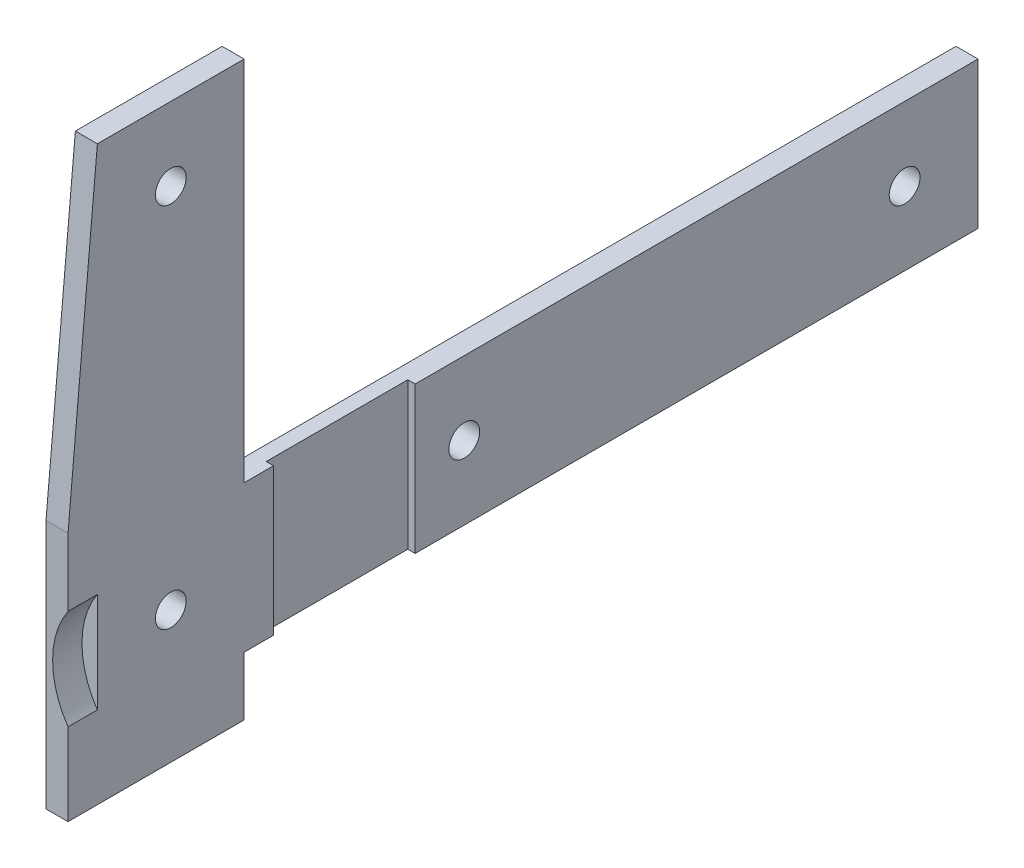
ISO-10303-21;
HEADER;
FILE_DESCRIPTION(('STEP AP214'),'2;1');
FILE_NAME('part.step','',(''),(''),'','','');
FILE_SCHEMA(('AUTOMOTIVE_DESIGN { 1 0 10303 214 1 1 1 1 }'));
ENDSEC;
DATA;
#1=APPLICATION_CONTEXT('core data for automotive mechanical design processes');
#2=APPLICATION_PROTOCOL_DEFINITION('international standard','automotive_design',2000,#1);
#3=PRODUCT_CONTEXT('',#1,'mechanical');
#4=PRODUCT('Part','Part','',(#3));
#5=PRODUCT_RELATED_PRODUCT_CATEGORY('part','',(#4));
#6=PRODUCT_DEFINITION_FORMATION('','',#4);
#7=PRODUCT_DEFINITION_CONTEXT('part definition',#1,'design');
#8=PRODUCT_DEFINITION('design','',#6,#7);
#9=PRODUCT_DEFINITION_SHAPE('','',#8);
#10=(LENGTH_UNIT() NAMED_UNIT(*) SI_UNIT(.MILLI.,.METRE.));
#11=(NAMED_UNIT(*) PLANE_ANGLE_UNIT() SI_UNIT($,.RADIAN.));
#12=(NAMED_UNIT(*) SI_UNIT($,.STERADIAN.) SOLID_ANGLE_UNIT());
#13=UNCERTAINTY_MEASURE_WITH_UNIT(LENGTH_MEASURE(1.E-05),#10,'distance_accuracy_value','');
#14=(GEOMETRIC_REPRESENTATION_CONTEXT(3) GLOBAL_UNCERTAINTY_ASSIGNED_CONTEXT((#13)) GLOBAL_UNIT_ASSIGNED_CONTEXT((#10,
#11,#12)) REPRESENTATION_CONTEXT('',''));
#15=CARTESIAN_POINT('',(0.,0.,0.));
#16=DIRECTION('',(0.,0.,1.));
#17=DIRECTION('',(1.,0.,0.));
#18=AXIS2_PLACEMENT_3D('',#15,#16,#17);
#19=CARTESIAN_POINT('',(0.,0.,-309.000000000001));
#20=DIRECTION('',(0.,0.,-1.));
#21=DIRECTION('',(0.,-1.,0.));
#22=AXIS2_PLACEMENT_3D('',#19,#20,#21);
#23=PLANE('',#22);
#24=CARTESIAN_POINT('',(0.,0.,-309.000000000001));
#25=DIRECTION('',(0.,0.,-1.));
#26=DIRECTION('',(0.,1.,0.));
#27=AXIS2_PLACEMENT_3D('',#24,#25,#26);
#28=CIRCLE('',#27,12.1);
#29=CARTESIAN_POINT('',(-9.99999999999999,-6.81248853210037,-309.000000000001));
#30=VERTEX_POINT('',#29);
#31=CARTESIAN_POINT('',(-9.99999999999999,6.8124885321005,-309.000000000001));
#32=VERTEX_POINT('',#31);
#33=EDGE_CURVE('E42',#30,#32,#28,.T.);
#34=ORIENTED_EDGE('',*,*,#33,.F.);
#35=DIRECTION('',(0.,-1.,0.));
#36=VECTOR('',#35,1.);
#37=CARTESIAN_POINT('',(-10.,20.9999999999999,-309.000000000001));
#38=LINE('',#37,#36);
#39=EDGE_CURVE('E151',#32,#30,#38,.T.);
#40=ORIENTED_EDGE('',*,*,#39,.F.);
#41=EDGE_LOOP('',(#34,#40));
#42=FACE_BOUND('',#41,.T.);
#43=ADVANCED_FACE('F39',(#42),#23,.F.);
#44=CARTESIAN_POINT('',(-10.,9.99999999999988,-333.000000000001));
#45=DIRECTION('',(0.,0.,1.));
#46=DIRECTION('',(-1.,0.,0.));
#47=AXIS2_PLACEMENT_3D('',#44,#45,#46);
#48=PLANE('',#47);
#49=DIRECTION('',(-1.,0.,0.));
#50=VECTOR('',#49,1.);
#51=CARTESIAN_POINT('',(-10.,9.99999999999988,-333.000000000001));
#52=LINE('',#51,#50);
#53=CARTESIAN_POINT('',(-11.,9.99999999999988,-333.000000000001));
#54=VERTEX_POINT('',#53);
#55=CARTESIAN_POINT('',(-10.,9.99999999999988,-333.000000000001));
#56=VERTEX_POINT('',#55);
#57=EDGE_CURVE('E176',#54,#56,#52,.F.);
#58=ORIENTED_EDGE('',*,*,#57,.T.);
#59=DIRECTION('',(0.,-1.,0.));
#60=VECTOR('',#59,1.);
#61=CARTESIAN_POINT('',(-10.,20.9999999999999,-333.000000000001));
#62=LINE('',#61,#60);
#63=CARTESIAN_POINT('',(-9.99999999999999,-10.0000000000002,-333.000000000001));
#64=VERTEX_POINT('',#63);
#65=EDGE_CURVE('E158',#64,#56,#62,.F.);
#66=ORIENTED_EDGE('',*,*,#65,.F.);
#67=DIRECTION('',(-1.,0.,0.));
#68=VECTOR('',#67,1.);
#69=CARTESIAN_POINT('',(-10.,-10.0000000000002,-333.000000000001));
#70=LINE('',#69,#68);
#71=CARTESIAN_POINT('',(-11.,-10.0000000000002,-333.000000000001));
#72=VERTEX_POINT('',#71);
#73=EDGE_CURVE('E184',#64,#72,#70,.T.);
#74=ORIENTED_EDGE('',*,*,#73,.T.);
#75=DIRECTION('',(0.,1.,0.));
#76=VECTOR('',#75,1.);
#77=CARTESIAN_POINT('',(-11.,-1.4432899320127E-13,-333.000000000001));
#78=LINE('',#77,#76);
#79=EDGE_CURVE('E161',#54,#72,#78,.F.);
#80=ORIENTED_EDGE('',*,*,#79,.F.);
#81=EDGE_LOOP('',(#58,#66,#74,#80));
#82=FACE_BOUND('',#81,.T.);
#83=ADVANCED_FACE('F361',(#82),#48,.F.);
#84=CARTESIAN_POINT('',(-10.,-10.0000000000002,-352.300000000001));
#85=DIRECTION('',(0.,0.,-1.));
#86=DIRECTION('',(1.,0.,0.));
#87=AXIS2_PLACEMENT_3D('',#84,#85,#86);
#88=PLANE('',#87);
#89=DIRECTION('',(1.,0.,0.));
#90=VECTOR('',#89,1.);
#91=CARTESIAN_POINT('',(-10.,-10.0000000000002,-352.300000000001));
#92=LINE('',#91,#90);
#93=CARTESIAN_POINT('',(-11.,-10.0000000000002,-352.300000000001));
#94=VERTEX_POINT('',#93);
#95=CARTESIAN_POINT('',(-10.,-10.0000000000002,-352.300000000001));
#96=VERTEX_POINT('',#95);
#97=EDGE_CURVE('E165',#94,#96,#92,.T.);
#98=ORIENTED_EDGE('',*,*,#97,.T.);
#99=DIRECTION('',(0.,-1.,0.));
#100=VECTOR('',#99,1.);
#101=CARTESIAN_POINT('',(-10.,20.9999999999999,-352.300000000001));
#102=LINE('',#101,#100);
#103=CARTESIAN_POINT('',(-10.,9.99999999999988,-352.300000000001));
#104=VERTEX_POINT('',#103);
#105=EDGE_CURVE('E157',#104,#96,#102,.T.);
#106=ORIENTED_EDGE('',*,*,#105,.F.);
#107=DIRECTION('',(1.,0.,0.));
#108=VECTOR('',#107,1.);
#109=CARTESIAN_POINT('',(-10.,9.99999999999988,-352.300000000001));
#110=LINE('',#109,#108);
#111=CARTESIAN_POINT('',(-11.,9.99999999999988,-352.300000000001));
#112=VERTEX_POINT('',#111);
#113=EDGE_CURVE('E169',#104,#112,#110,.F.);
#114=ORIENTED_EDGE('',*,*,#113,.T.);
#115=DIRECTION('',(0.,1.,0.));
#116=VECTOR('',#115,1.);
#117=CARTESIAN_POINT('',(-11.,-1.4432899320127E-13,-352.300000000001));
#118=LINE('',#117,#116);
#119=EDGE_CURVE('E164',#94,#112,#118,.T.);
#120=ORIENTED_EDGE('',*,*,#119,.F.);
#121=EDGE_LOOP('',(#98,#106,#114,#120));
#122=FACE_BOUND('',#121,.T.);
#123=ADVANCED_FACE('F375',(#122),#88,.F.);
#124=CARTESIAN_POINT('',(0.,0.,-309.000000000001));
#125=DIRECTION('',(0.,0.,1.));
#126=DIRECTION('',(0.,1.,0.));
#127=AXIS2_PLACEMENT_3D('',#124,#125,#126);
#128=CYLINDRICAL_SURFACE('',#127,12.1);
#129=ORIENTED_EDGE('',*,*,#33,.T.);
#130=DIRECTION('',(0.,0.,-1.));
#131=VECTOR('',#130,1.);
#132=CARTESIAN_POINT('',(-9.99999999999999,6.81248853210048,-367.000000000001));
#133=LINE('',#132,#131);
#134=CARTESIAN_POINT('',(-10.,6.8124885321005,-305.000000000001));
#135=VERTEX_POINT('',#134);
#136=EDGE_CURVE('E148',#135,#32,#133,.T.);
#137=ORIENTED_EDGE('',*,*,#136,.F.);
#138=CARTESIAN_POINT('',(0.,0.,-305.000000000001));
#139=DIRECTION('',(0.,0.,-1.));
#140=DIRECTION('',(0.,1.,0.));
#141=AXIS2_PLACEMENT_3D('',#138,#139,#140);
#142=CIRCLE('',#141,12.1);
#143=CARTESIAN_POINT('',(-9.99999999999999,-6.81248853210036,-305.000000000001));
#144=VERTEX_POINT('',#143);
#145=EDGE_CURVE('E232',#135,#144,#142,.F.);
#146=ORIENTED_EDGE('',*,*,#145,.T.);
#147=DIRECTION('',(0.,0.,-1.));
#148=VECTOR('',#147,1.);
#149=CARTESIAN_POINT('',(-9.99999999999999,-6.81248853210035,-367.000000000001));
#150=LINE('',#149,#148);
#151=EDGE_CURVE('E143',#30,#144,#150,.F.);
#152=ORIENTED_EDGE('',*,*,#151,.F.);
#153=EDGE_LOOP('',(#129,#137,#146,#152));
#154=FACE_BOUND('',#153,.T.);
#155=ADVANCED_FACE('F163',(#154),#128,.F.);
#156=CARTESIAN_POINT('',(-11.,-1.4432899320127E-13,-342.650000000001));
#157=DIRECTION('',(-1.,0.,0.));
#158=DIRECTION('',(0.,0.,-1.));
#159=AXIS2_PLACEMENT_3D('',#156,#157,#158);
#160=PLANE('',#159);
#161=ORIENTED_EDGE('',*,*,#79,.T.);
#162=DIRECTION('',(0.,0.,-1.));
#163=VECTOR('',#162,1.);
#164=CARTESIAN_POINT('',(-11.,-10.0000000000002,-329.000000000001));
#165=LINE('',#164,#163);
#166=EDGE_CURVE('E207',#72,#94,#165,.T.);
#167=ORIENTED_EDGE('',*,*,#166,.T.);
#168=ORIENTED_EDGE('',*,*,#119,.T.);
#169=DIRECTION('',(0.,0.,-1.));
#170=VECTOR('',#169,1.);
#171=CARTESIAN_POINT('',(-11.,9.99999999999987,-429.000000000001));
#172=LINE('',#171,#170);
#173=EDGE_CURVE('E201',#112,#54,#172,.F.);
#174=ORIENTED_EDGE('',*,*,#173,.T.);
#175=EDGE_LOOP('',(#161,#167,#168,#174));
#176=FACE_BOUND('',#175,.T.);
#177=ADVANCED_FACE('F377',(#176),#160,.F.);
#178=CARTESIAN_POINT('',(-10.,20.9999999999999,-367.000000000001));
#179=DIRECTION('',(-1.,0.,0.));
#180=DIRECTION('',(0.,-1.,0.));
#181=AXIS2_PLACEMENT_3D('',#178,#179,#180);
#182=PLANE('',#181);
#183=CARTESIAN_POINT('',(-10.,-1.19583449414767E-13,-319.000000000001));
#184=DIRECTION('',(1.,0.,0.));
#185=DIRECTION('',(0.,-1.,0.));
#186=AXIS2_PLACEMENT_3D('',#183,#184,#185);
#187=CIRCLE('',#186,2.09999999999999);
#188=CARTESIAN_POINT('',(-10.,-2.10000000000011,-319.000000000001));
#189=VERTEX_POINT('',#188);
#190=EDGE_CURVE('E193',#189,#189,#187,.T.);
#191=ORIENTED_EDGE('',*,*,#190,.F.);
#192=EDGE_LOOP('',(#191));
#193=FACE_BOUND('',#192,.T.);
#194=CARTESIAN_POINT('',(-10.,49.9999999999999,-319.000000000001));
#195=DIRECTION('',(1.,0.,0.));
#196=DIRECTION('',(0.,-1.,0.));
#197=AXIS2_PLACEMENT_3D('',#194,#195,#196);
#198=CIRCLE('',#197,2.1);
#199=CARTESIAN_POINT('',(-10.,47.8999999999999,-319.000000000001));
#200=VERTEX_POINT('',#199);
#201=EDGE_CURVE('E228',#200,#200,#198,.T.);
#202=ORIENTED_EDGE('',*,*,#201,.F.);
#203=EDGE_LOOP('',(#202));
#204=FACE_BOUND('',#203,.T.);
#205=DIRECTION('',(0.,1.,0.));
#206=VECTOR('',#205,1.);
#207=CARTESIAN_POINT('',(-10.,16.0497443313968,-305.000000000001));
#208=LINE('',#207,#206);
#209=CARTESIAN_POINT('',(-10.,16.0497443313968,-305.000000000001));
#210=VERTEX_POINT('',#209);
#211=EDGE_CURVE('E155',#210,#135,#208,.F.);
#212=ORIENTED_EDGE('',*,*,#211,.T.);
#213=ORIENTED_EDGE('',*,*,#136,.T.);
#214=ORIENTED_EDGE('',*,*,#39,.T.);
#215=ORIENTED_EDGE('',*,*,#151,.T.);
#216=DIRECTION('',(0.,1.,0.));
#217=VECTOR('',#216,1.);
#218=CARTESIAN_POINT('',(-10.,16.0497443313968,-305.000000000001));
#219=LINE('',#218,#217);
#220=CARTESIAN_POINT('',(-10.,-18.,-305.000000000001));
#221=VERTEX_POINT('',#220);
#222=EDGE_CURVE('E233',#144,#221,#219,.F.);
#223=ORIENTED_EDGE('',*,*,#222,.T.);
#224=DIRECTION('',(0.,0.,-1.));
#225=VECTOR('',#224,1.);
#226=CARTESIAN_POINT('',(-10.,-18.,-305.000000000001));
#227=LINE('',#226,#225);
#228=CARTESIAN_POINT('',(-9.99999999999999,-18.,-329.000000000001));
#229=VERTEX_POINT('',#228);
#230=EDGE_CURVE('E278',#221,#229,#227,.T.);
#231=ORIENTED_EDGE('',*,*,#230,.T.);
#232=DIRECTION('',(0.,-1.,0.));
#233=VECTOR('',#232,1.);
#234=CARTESIAN_POINT('',(-10.,-18.,-329.000000000001));
#235=LINE('',#234,#233);
#236=CARTESIAN_POINT('',(-10.,-10.0000000000002,-329.000000000001));
#237=VERTEX_POINT('',#236);
#238=EDGE_CURVE('E285',#229,#237,#235,.F.);
#239=ORIENTED_EDGE('',*,*,#238,.T.);
#240=DIRECTION('',(0.,0.,-1.));
#241=VECTOR('',#240,1.);
#242=CARTESIAN_POINT('',(-10.,-10.0000000000002,-329.000000000001));
#243=LINE('',#242,#241);
#244=EDGE_CURVE('E191',#237,#64,#243,.T.);
#245=ORIENTED_EDGE('',*,*,#244,.T.);
#246=ORIENTED_EDGE('',*,*,#65,.T.);
#247=DIRECTION('',(0.,0.,-1.));
#248=VECTOR('',#247,1.);
#249=CARTESIAN_POINT('',(-10.,9.99999999999987,-429.000000000001));
#250=LINE('',#249,#248);
#251=CARTESIAN_POINT('',(-10.,9.99999999999988,-329.000000000001));
#252=VERTEX_POINT('',#251);
#253=EDGE_CURVE('E262',#56,#252,#250,.F.);
#254=ORIENTED_EDGE('',*,*,#253,.T.);
#255=DIRECTION('',(0.,-1.,0.));
#256=VECTOR('',#255,1.);
#257=CARTESIAN_POINT('',(-10.,9.99999999999988,-329.000000000001));
#258=LINE('',#257,#256);
#259=CARTESIAN_POINT('',(-10.,59.9999999999999,-329.000000000001));
#260=VERTEX_POINT('',#259);
#261=EDGE_CURVE('E203',#252,#260,#258,.F.);
#262=ORIENTED_EDGE('',*,*,#261,.T.);
#263=DIRECTION('',(0.,0.,-1.));
#264=VECTOR('',#263,1.);
#265=CARTESIAN_POINT('',(-10.,59.9999999999999,-329.000000000001));
#266=LINE('',#265,#264);
#267=CARTESIAN_POINT('',(-10.,59.9999999999999,-309.000000000001));
#268=VERTEX_POINT('',#267);
#269=EDGE_CURVE('E259',#260,#268,#266,.F.);
#270=ORIENTED_EDGE('',*,*,#269,.T.);
#271=DIRECTION('',(0.,0.995883962151565,-0.0906373760062565));
#272=VECTOR('',#271,1.);
#273=CARTESIAN_POINT('',(-10.,59.9999999999999,-309.000000000001));
#274=LINE('',#273,#272);
#275=EDGE_CURVE('E238',#268,#210,#274,.F.);
#276=ORIENTED_EDGE('',*,*,#275,.T.);
#277=EDGE_LOOP('',(#212,#213,#214,#215,#223,#231,#239,#245,#246,#254,#262,#270,#276));
#278=FACE_BOUND('',#277,.T.);
#279=ADVANCED_FACE('F150',(#193,#204,#278),#182,.F.);
#280=CARTESIAN_POINT('',(-10.,20.9999999999999,-367.000000000001));
#281=DIRECTION('',(-1.,0.,0.));
#282=DIRECTION('',(0.,-1.,0.));
#283=AXIS2_PLACEMENT_3D('',#280,#281,#282);
#284=PLANE('',#283);
#285=CARTESIAN_POINT('',(-10.,-1.82269356388673E-13,-359.000000000001));
#286=DIRECTION('',(1.,0.,0.));
#287=DIRECTION('',(0.,-1.,0.));
#288=AXIS2_PLACEMENT_3D('',#285,#286,#287);
#289=CIRCLE('',#288,2.1);
#290=CARTESIAN_POINT('',(-10.,-2.10000000000018,-359.000000000001));
#291=VERTEX_POINT('',#290);
#292=EDGE_CURVE('E221',#291,#291,#289,.T.);
#293=ORIENTED_EDGE('',*,*,#292,.F.);
#294=EDGE_LOOP('',(#293));
#295=FACE_BOUND('',#294,.T.);
#296=CARTESIAN_POINT('',(-10.,-1.83630888273001E-13,-419.000000000001));
#297=DIRECTION('',(1.,0.,0.));
#298=DIRECTION('',(0.,-1.,0.));
#299=AXIS2_PLACEMENT_3D('',#296,#297,#298);
#300=CIRCLE('',#299,2.1);
#301=CARTESIAN_POINT('',(-10.,-2.10000000000018,-419.000000000001));
#302=VERTEX_POINT('',#301);
#303=EDGE_CURVE('E225',#302,#302,#300,.T.);
#304=ORIENTED_EDGE('',*,*,#303,.F.);
#305=EDGE_LOOP('',(#304));
#306=FACE_BOUND('',#305,.T.);
#307=DIRECTION('',(0.,0.,-1.));
#308=VECTOR('',#307,1.);
#309=CARTESIAN_POINT('',(-10.,9.99999999999987,-429.000000000001));
#310=LINE('',#309,#308);
#311=CARTESIAN_POINT('',(-10.,9.99999999999987,-429.000000000001));
#312=VERTEX_POINT('',#311);
#313=EDGE_CURVE('E204',#312,#104,#310,.F.);
#314=ORIENTED_EDGE('',*,*,#313,.T.);
#315=ORIENTED_EDGE('',*,*,#105,.T.);
#316=DIRECTION('',(0.,0.,-1.));
#317=VECTOR('',#316,1.);
#318=CARTESIAN_POINT('',(-10.,-10.0000000000002,-329.000000000001));
#319=LINE('',#318,#317);
#320=CARTESIAN_POINT('',(-9.99999999999999,-10.0000000000002,-429.000000000001));
#321=VERTEX_POINT('',#320);
#322=EDGE_CURVE('E209',#96,#321,#319,.T.);
#323=ORIENTED_EDGE('',*,*,#322,.T.);
#324=DIRECTION('',(0.,-1.,0.));
#325=VECTOR('',#324,1.);
#326=CARTESIAN_POINT('',(-10.,-10.0000000000002,-429.000000000001));
#327=LINE('',#326,#325);
#328=EDGE_CURVE('E266',#321,#312,#327,.F.);
#329=ORIENTED_EDGE('',*,*,#328,.T.);
#330=EDGE_LOOP('',(#314,#315,#323,#329));
#331=FACE_BOUND('',#330,.T.);
#332=ADVANCED_FACE('F374',(#295,#306,#331),#284,.F.);
#333=CARTESIAN_POINT('',(-10.,-10.0000000000002,-429.000000000001));
#334=DIRECTION('',(0.,0.,-1.));
#335=DIRECTION('',(0.,-1.,0.));
#336=AXIS2_PLACEMENT_3D('',#333,#334,#335);
#337=PLANE('',#336);
#338=DIRECTION('',(0.,-1.,0.));
#339=VECTOR('',#338,1.);
#340=CARTESIAN_POINT('',(-13.,20.9999999999999,-429.000000000001));
#341=LINE('',#340,#339);
#342=CARTESIAN_POINT('',(-13.,-10.0000000000002,-429.000000000001));
#343=VERTEX_POINT('',#342);
#344=CARTESIAN_POINT('',(-13.,9.99999999999987,-429.000000000001));
#345=VERTEX_POINT('',#344);
#346=EDGE_CURVE('E224',#343,#345,#341,.F.);
#347=ORIENTED_EDGE('',*,*,#346,.T.);
#348=DIRECTION('',(-1.,0.,0.));
#349=VECTOR('',#348,1.);
#350=CARTESIAN_POINT('',(-10.,9.99999999999987,-429.000000000001));
#351=LINE('',#350,#349);
#352=EDGE_CURVE('E265',#345,#312,#351,.F.);
#353=ORIENTED_EDGE('',*,*,#352,.T.);
#354=ORIENTED_EDGE('',*,*,#328,.F.);
#355=DIRECTION('',(1.,0.,0.));
#356=VECTOR('',#355,1.);
#357=CARTESIAN_POINT('',(-10.,-10.0000000000002,-429.000000000001));
#358=LINE('',#357,#356);
#359=EDGE_CURVE('E308',#321,#343,#358,.F.);
#360=ORIENTED_EDGE('',*,*,#359,.T.);
#361=EDGE_LOOP('',(#347,#353,#354,#360));
#362=FACE_BOUND('',#361,.T.);
#363=ADVANCED_FACE('F369',(#362),#337,.T.);
#364=CARTESIAN_POINT('',(-10.,9.99999999999987,-429.000000000001));
#365=DIRECTION('',(0.,1.,0.));
#366=DIRECTION('',(-1.,0.,0.));
#367=AXIS2_PLACEMENT_3D('',#364,#365,#366);
#368=PLANE('',#367);
#369=ORIENTED_EDGE('',*,*,#113,.F.);
#370=ORIENTED_EDGE('',*,*,#313,.F.);
#371=ORIENTED_EDGE('',*,*,#352,.F.);
#372=DIRECTION('',(0.,0.,-1.));
#373=VECTOR('',#372,1.);
#374=CARTESIAN_POINT('',(-13.,9.99999999999987,-367.000000000001));
#375=LINE('',#374,#373);
#376=CARTESIAN_POINT('',(-13.,9.99999999999987,-329.000000000001));
#377=VERTEX_POINT('',#376);
#378=EDGE_CURVE('E298',#345,#377,#375,.F.);
#379=ORIENTED_EDGE('',*,*,#378,.T.);
#380=DIRECTION('',(1.,0.,0.));
#381=VECTOR('',#380,1.);
#382=CARTESIAN_POINT('',(-10.,9.99999999999988,-329.000000000001));
#383=LINE('',#382,#381);
#384=EDGE_CURVE('E255',#377,#252,#383,.T.);
#385=ORIENTED_EDGE('',*,*,#384,.T.);
#386=ORIENTED_EDGE('',*,*,#253,.F.);
#387=ORIENTED_EDGE('',*,*,#57,.F.);
#388=ORIENTED_EDGE('',*,*,#173,.F.);
#389=EDGE_LOOP('',(#369,#370,#371,#379,#385,#386,#387,#388));
#390=FACE_BOUND('',#389,.T.);
#391=ADVANCED_FACE('F365',(#390),#368,.T.);
#392=CARTESIAN_POINT('',(-10.,9.99999999999988,-329.000000000001));
#393=DIRECTION('',(0.,0.,-1.));
#394=DIRECTION('',(0.,-1.,0.));
#395=AXIS2_PLACEMENT_3D('',#392,#393,#394);
#396=PLANE('',#395);
#397=DIRECTION('',(0.,-1.,0.));
#398=VECTOR('',#397,1.);
#399=CARTESIAN_POINT('',(-13.,20.9999999999999,-329.000000000001));
#400=LINE('',#399,#398);
#401=CARTESIAN_POINT('',(-13.,59.9999999999999,-329.000000000001));
#402=VERTEX_POINT('',#401);
#403=EDGE_CURVE('E295',#377,#402,#400,.F.);
#404=ORIENTED_EDGE('',*,*,#403,.T.);
#405=DIRECTION('',(-1.,0.,0.));
#406=VECTOR('',#405,1.);
#407=CARTESIAN_POINT('',(-10.,59.9999999999999,-329.000000000001));
#408=LINE('',#407,#406);
#409=EDGE_CURVE('E245',#402,#260,#408,.F.);
#410=ORIENTED_EDGE('',*,*,#409,.T.);
#411=ORIENTED_EDGE('',*,*,#261,.F.);
#412=ORIENTED_EDGE('',*,*,#384,.F.);
#413=EDGE_LOOP('',(#404,#410,#411,#412));
#414=FACE_BOUND('',#413,.T.);
#415=ADVANCED_FACE('F296',(#414),#396,.T.);
#416=CARTESIAN_POINT('',(-10.,59.9999999999999,-329.000000000001));
#417=DIRECTION('',(0.,1.,0.));
#418=DIRECTION('',(-1.,0.,0.));
#419=AXIS2_PLACEMENT_3D('',#416,#417,#418);
#420=PLANE('',#419);
#421=DIRECTION('',(0.,0.,-1.));
#422=VECTOR('',#421,1.);
#423=CARTESIAN_POINT('',(-13.,59.9999999999999,-367.000000000001));
#424=LINE('',#423,#422);
#425=CARTESIAN_POINT('',(-13.,59.9999999999999,-309.000000000001));
#426=VERTEX_POINT('',#425);
#427=EDGE_CURVE('E292',#402,#426,#424,.F.);
#428=ORIENTED_EDGE('',*,*,#427,.T.);
#429=DIRECTION('',(1.,0.,0.));
#430=VECTOR('',#429,1.);
#431=CARTESIAN_POINT('',(-10.,59.9999999999999,-309.000000000001));
#432=LINE('',#431,#430);
#433=EDGE_CURVE('E234',#426,#268,#432,.T.);
#434=ORIENTED_EDGE('',*,*,#433,.T.);
#435=ORIENTED_EDGE('',*,*,#269,.F.);
#436=ORIENTED_EDGE('',*,*,#409,.F.);
#437=EDGE_LOOP('',(#428,#434,#435,#436));
#438=FACE_BOUND('',#437,.T.);
#439=ADVANCED_FACE('F290',(#438),#420,.T.);
#440=CARTESIAN_POINT('',(-10.,59.9999999999999,-309.000000000001));
#441=DIRECTION('',(0.,0.0906373760062565,0.995883962151565));
#442=DIRECTION('',(0.,0.995883962151565,-0.0906373760062565));
#443=AXIS2_PLACEMENT_3D('',#440,#441,#442);
#444=PLANE('',#443);
#445=DIRECTION('',(0.,-0.995883962151565,0.0906373760062561));
#446=VECTOR('',#445,1.);
#447=CARTESIAN_POINT('',(-13.,59.9999999999999,-309.000000000001));
#448=LINE('',#447,#446);
#449=CARTESIAN_POINT('',(-13.,16.0497443313968,-305.000000000001));
#450=VERTEX_POINT('',#449);
#451=EDGE_CURVE('E300',#426,#450,#448,.T.);
#452=ORIENTED_EDGE('',*,*,#451,.T.);
#453=DIRECTION('',(1.,0.,0.));
#454=VECTOR('',#453,1.);
#455=CARTESIAN_POINT('',(-10.,16.0497443313968,-305.000000000001));
#456=LINE('',#455,#454);
#457=EDGE_CURVE('E236',#450,#210,#456,.T.);
#458=ORIENTED_EDGE('',*,*,#457,.T.);
#459=ORIENTED_EDGE('',*,*,#275,.F.);
#460=ORIENTED_EDGE('',*,*,#433,.F.);
#461=EDGE_LOOP('',(#452,#458,#459,#460));
#462=FACE_BOUND('',#461,.T.);
#463=ADVANCED_FACE('F339',(#462),#444,.T.);
#464=CARTESIAN_POINT('',(-10.,16.0497443313968,-305.000000000001));
#465=DIRECTION('',(0.,0.,1.));
#466=DIRECTION('',(0.,1.,0.));
#467=AXIS2_PLACEMENT_3D('',#464,#465,#466);
#468=PLANE('',#467);
#469=ORIENTED_EDGE('',*,*,#457,.F.);
#470=DIRECTION('',(0.,-1.,0.));
#471=VECTOR('',#470,1.);
#472=CARTESIAN_POINT('',(-13.,20.9999999999999,-305.000000000001));
#473=LINE('',#472,#471);
#474=CARTESIAN_POINT('',(-13.,-18.,-305.000000000001));
#475=VERTEX_POINT('',#474);
#476=EDGE_CURVE('E332',#450,#475,#473,.T.);
#477=ORIENTED_EDGE('',*,*,#476,.T.);
#478=DIRECTION('',(1.,0.,0.));
#479=VECTOR('',#478,1.);
#480=CARTESIAN_POINT('',(-10.,-18.,-305.000000000001));
#481=LINE('',#480,#479);
#482=EDGE_CURVE('E281',#475,#221,#481,.T.);
#483=ORIENTED_EDGE('',*,*,#482,.T.);
#484=ORIENTED_EDGE('',*,*,#222,.F.);
#485=ORIENTED_EDGE('',*,*,#145,.F.);
#486=ORIENTED_EDGE('',*,*,#211,.F.);
#487=EDGE_LOOP('',(#469,#477,#483,#484,#485,#486));
#488=FACE_BOUND('',#487,.T.);
#489=ADVANCED_FACE('F345',(#488),#468,.T.);
#490=CARTESIAN_POINT('',(-10.,-18.,-305.000000000001));
#491=DIRECTION('',(0.,-1.,0.));
#492=DIRECTION('',(1.,0.,0.));
#493=AXIS2_PLACEMENT_3D('',#490,#491,#492);
#494=PLANE('',#493);
#495=DIRECTION('',(0.,0.,-1.));
#496=VECTOR('',#495,1.);
#497=CARTESIAN_POINT('',(-13.,-18.,-367.000000000001));
#498=LINE('',#497,#496);
#499=CARTESIAN_POINT('',(-13.,-18.,-329.000000000001));
#500=VERTEX_POINT('',#499);
#501=EDGE_CURVE('E335',#475,#500,#498,.T.);
#502=ORIENTED_EDGE('',*,*,#501,.T.);
#503=DIRECTION('',(1.,0.,0.));
#504=VECTOR('',#503,1.);
#505=CARTESIAN_POINT('',(-10.,-18.,-329.000000000001));
#506=LINE('',#505,#504);
#507=EDGE_CURVE('E210',#500,#229,#506,.T.);
#508=ORIENTED_EDGE('',*,*,#507,.T.);
#509=ORIENTED_EDGE('',*,*,#230,.F.);
#510=ORIENTED_EDGE('',*,*,#482,.F.);
#511=EDGE_LOOP('',(#502,#508,#509,#510));
#512=FACE_BOUND('',#511,.T.);
#513=ADVANCED_FACE('F349',(#512),#494,.T.);
#514=CARTESIAN_POINT('',(-10.,-18.,-329.000000000001));
#515=DIRECTION('',(0.,0.,-1.));
#516=DIRECTION('',(0.,-1.,0.));
#517=AXIS2_PLACEMENT_3D('',#514,#515,#516);
#518=PLANE('',#517);
#519=DIRECTION('',(0.,-1.,0.));
#520=VECTOR('',#519,1.);
#521=CARTESIAN_POINT('',(-13.,20.9999999999999,-329.000000000001));
#522=LINE('',#521,#520);
#523=CARTESIAN_POINT('',(-13.,-10.0000000000002,-329.000000000001));
#524=VERTEX_POINT('',#523);
#525=EDGE_CURVE('E355',#500,#524,#522,.F.);
#526=ORIENTED_EDGE('',*,*,#525,.T.);
#527=DIRECTION('',(1.,0.,0.));
#528=VECTOR('',#527,1.);
#529=CARTESIAN_POINT('',(-10.,-10.0000000000002,-329.000000000001));
#530=LINE('',#529,#528);
#531=EDGE_CURVE('E194',#524,#237,#530,.T.);
#532=ORIENTED_EDGE('',*,*,#531,.T.);
#533=ORIENTED_EDGE('',*,*,#238,.F.);
#534=ORIENTED_EDGE('',*,*,#507,.F.);
#535=EDGE_LOOP('',(#526,#532,#533,#534));
#536=FACE_BOUND('',#535,.T.);
#537=ADVANCED_FACE('F353',(#536),#518,.T.);
#538=CARTESIAN_POINT('',(-10.,-10.0000000000002,-329.000000000001));
#539=DIRECTION('',(0.,-1.,0.));
#540=DIRECTION('',(1.,0.,0.));
#541=AXIS2_PLACEMENT_3D('',#538,#539,#540);
#542=PLANE('',#541);
#543=ORIENTED_EDGE('',*,*,#531,.F.);
#544=DIRECTION('',(0.,0.,-1.));
#545=VECTOR('',#544,1.);
#546=CARTESIAN_POINT('',(-13.,-10.0000000000002,-367.000000000001));
#547=LINE('',#546,#545);
#548=EDGE_CURVE('E57',#524,#343,#547,.T.);
#549=ORIENTED_EDGE('',*,*,#548,.T.);
#550=ORIENTED_EDGE('',*,*,#359,.F.);
#551=ORIENTED_EDGE('',*,*,#322,.F.);
#552=ORIENTED_EDGE('',*,*,#97,.F.);
#553=ORIENTED_EDGE('',*,*,#166,.F.);
#554=ORIENTED_EDGE('',*,*,#73,.F.);
#555=ORIENTED_EDGE('',*,*,#244,.F.);
#556=EDGE_LOOP('',(#543,#549,#550,#551,#552,#553,#554,#555));
#557=FACE_BOUND('',#556,.T.);
#558=ADVANCED_FACE('F358',(#557),#542,.T.);
#559=CARTESIAN_POINT('',(-10.,-1.19583449414767E-13,-319.000000000001));
#560=DIRECTION('',(-1.,0.,0.));
#561=DIRECTION('',(0.,-1.,0.));
#562=AXIS2_PLACEMENT_3D('',#559,#560,#561);
#563=CYLINDRICAL_SURFACE('',#562,2.09999999999999);
#564=ORIENTED_EDGE('',*,*,#190,.T.);
#565=EDGE_LOOP('',(#564));
#566=FACE_BOUND('',#565,.T.);
#567=CARTESIAN_POINT('',(-13.,-1.20971228195548E-13,-319.000000000001));
#568=DIRECTION('',(1.,0.,0.));
#569=DIRECTION('',(0.,-1.,0.));
#570=AXIS2_PLACEMENT_3D('',#567,#568,#569);
#571=CIRCLE('',#570,2.09999999999999);
#572=CARTESIAN_POINT('',(-13.,-2.10000000000011,-319.000000000001));
#573=VERTEX_POINT('',#572);
#574=EDGE_CURVE('E218',#573,#573,#571,.F.);
#575=ORIENTED_EDGE('',*,*,#574,.T.);
#576=EDGE_LOOP('',(#575));
#577=FACE_BOUND('',#576,.T.);
#578=ADVANCED_FACE('F493',(#566,#577),#563,.F.);
#579=CARTESIAN_POINT('',(-10.,49.9999999999999,-319.000000000001));
#580=DIRECTION('',(-1.,0.,0.));
#581=DIRECTION('',(0.,-1.,0.));
#582=AXIS2_PLACEMENT_3D('',#579,#580,#581);
#583=CYLINDRICAL_SURFACE('',#582,2.1);
#584=ORIENTED_EDGE('',*,*,#201,.T.);
#585=EDGE_LOOP('',(#584));
#586=FACE_BOUND('',#585,.T.);
#587=CARTESIAN_POINT('',(-13.,49.9999999999999,-319.000000000001));
#588=DIRECTION('',(1.,0.,0.));
#589=DIRECTION('',(0.,-1.,0.));
#590=AXIS2_PLACEMENT_3D('',#587,#588,#589);
#591=CIRCLE('',#590,2.1);
#592=CARTESIAN_POINT('',(-13.,47.8999999999999,-319.000000000001));
#593=VERTEX_POINT('',#592);
#594=EDGE_CURVE('E215',#593,#593,#591,.F.);
#595=ORIENTED_EDGE('',*,*,#594,.T.);
#596=EDGE_LOOP('',(#595));
#597=FACE_BOUND('',#596,.T.);
#598=ADVANCED_FACE('F502',(#586,#597),#583,.F.);
#599=CARTESIAN_POINT('',(-10.,-1.83630888273001E-13,-419.000000000001));
#600=DIRECTION('',(-1.,0.,0.));
#601=DIRECTION('',(0.,-1.,0.));
#602=AXIS2_PLACEMENT_3D('',#599,#600,#601);
#603=CYLINDRICAL_SURFACE('',#602,2.1);
#604=ORIENTED_EDGE('',*,*,#303,.T.);
#605=EDGE_LOOP('',(#604));
#606=FACE_BOUND('',#605,.T.);
#607=CARTESIAN_POINT('',(-13.,-1.85018667053782E-13,-419.000000000001));
#608=DIRECTION('',(1.,0.,0.));
#609=DIRECTION('',(0.,-1.,0.));
#610=AXIS2_PLACEMENT_3D('',#607,#608,#609);
#611=CIRCLE('',#610,2.1);
#612=CARTESIAN_POINT('',(-13.,-2.10000000000019,-419.000000000001));
#613=VERTEX_POINT('',#612);
#614=EDGE_CURVE('E48',#613,#613,#611,.F.);
#615=ORIENTED_EDGE('',*,*,#614,.T.);
#616=EDGE_LOOP('',(#615));
#617=FACE_BOUND('',#616,.T.);
#618=ADVANCED_FACE('F512',(#606,#617),#603,.F.);
#619=CARTESIAN_POINT('',(-10.,-1.82269356388673E-13,-359.000000000001));
#620=DIRECTION('',(-1.,0.,0.));
#621=DIRECTION('',(0.,-1.,0.));
#622=AXIS2_PLACEMENT_3D('',#619,#620,#621);
#623=CYLINDRICAL_SURFACE('',#622,2.1);
#624=ORIENTED_EDGE('',*,*,#292,.T.);
#625=EDGE_LOOP('',(#624));
#626=FACE_BOUND('',#625,.T.);
#627=CARTESIAN_POINT('',(-13.,-1.83657135169454E-13,-359.000000000001));
#628=DIRECTION('',(1.,0.,0.));
#629=DIRECTION('',(0.,-1.,0.));
#630=AXIS2_PLACEMENT_3D('',#627,#628,#629);
#631=CIRCLE('',#630,2.1);
#632=CARTESIAN_POINT('',(-13.,-2.10000000000018,-359.000000000001));
#633=VERTEX_POINT('',#632);
#634=EDGE_CURVE('E11',#633,#633,#631,.F.);
#635=ORIENTED_EDGE('',*,*,#634,.T.);
#636=EDGE_LOOP('',(#635));
#637=FACE_BOUND('',#636,.T.);
#638=ADVANCED_FACE('F522',(#626,#637),#623,.F.);
#639=CARTESIAN_POINT('',(-13.,20.9999999999999,-367.000000000001));
#640=DIRECTION('',(-1.,0.,0.));
#641=DIRECTION('',(0.,-1.,0.));
#642=AXIS2_PLACEMENT_3D('',#639,#640,#641);
#643=PLANE('',#642);
#644=ORIENTED_EDGE('',*,*,#634,.F.);
#645=EDGE_LOOP('',(#644));
#646=FACE_BOUND('',#645,.T.);
#647=ORIENTED_EDGE('',*,*,#614,.F.);
#648=EDGE_LOOP('',(#647));
#649=FACE_BOUND('',#648,.T.);
#650=ORIENTED_EDGE('',*,*,#594,.F.);
#651=EDGE_LOOP('',(#650));
#652=FACE_BOUND('',#651,.T.);
#653=ORIENTED_EDGE('',*,*,#574,.F.);
#654=EDGE_LOOP('',(#653));
#655=FACE_BOUND('',#654,.T.);
#656=ORIENTED_EDGE('',*,*,#525,.F.);
#657=ORIENTED_EDGE('',*,*,#501,.F.);
#658=ORIENTED_EDGE('',*,*,#476,.F.);
#659=ORIENTED_EDGE('',*,*,#451,.F.);
#660=ORIENTED_EDGE('',*,*,#427,.F.);
#661=ORIENTED_EDGE('',*,*,#403,.F.);
#662=ORIENTED_EDGE('',*,*,#378,.F.);
#663=ORIENTED_EDGE('',*,*,#346,.F.);
#664=ORIENTED_EDGE('',*,*,#548,.F.);
#665=EDGE_LOOP('',(#656,#657,#658,#659,#660,#661,#662,#663,#664));
#666=FACE_BOUND('',#665,.T.);
#667=ADVANCED_FACE('F341',(#646,#649,#652,#655,#666),#643,.T.);
#668=CLOSED_SHELL('',(#43,#83,#123,#155,#177,#279,#332,#363,#391,#415,#439,#463,#489,#513,#537,
#558,#578,#598,#618,#638,#667));
#669=MANIFOLD_SOLID_BREP('B2',#668);
#670=ADVANCED_BREP_SHAPE_REPRESENTATION('',(#18,#669),#14);
#671=SHAPE_DEFINITION_REPRESENTATION(#9,#670);
ENDSEC;
END-ISO-10303-21;
